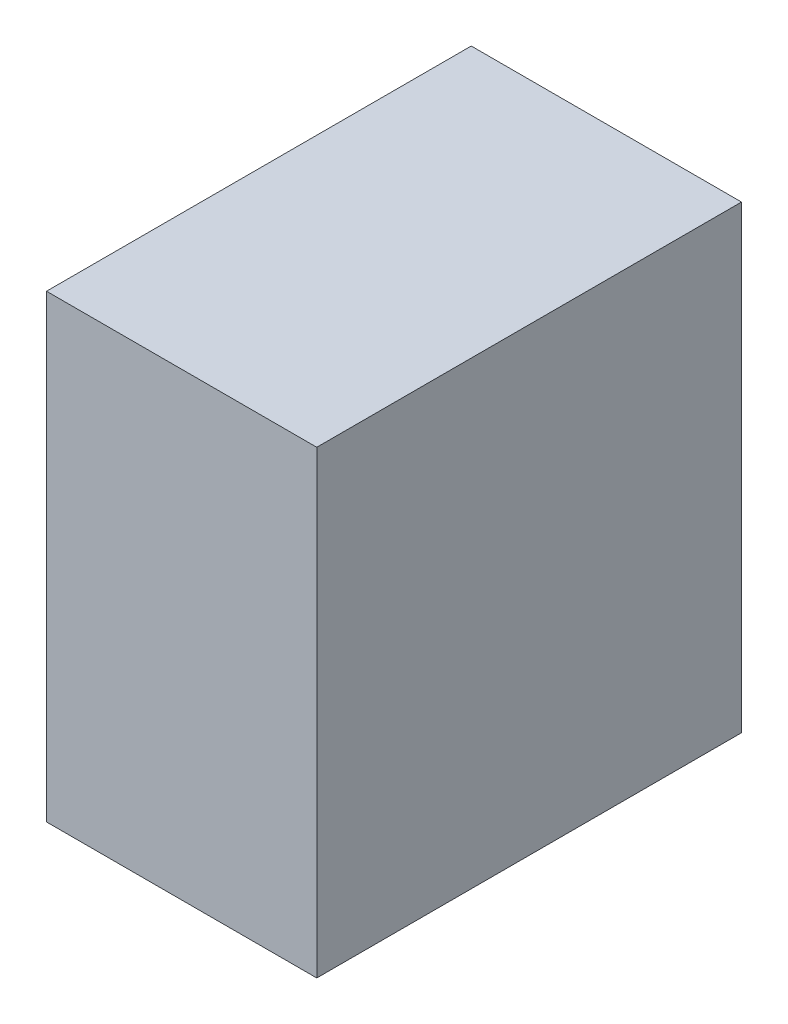
ISO-10303-21;
HEADER;
FILE_DESCRIPTION(('STEP AP214'),'2;1');
FILE_NAME('part.step','',(''),(''),'','','');
FILE_SCHEMA(('AUTOMOTIVE_DESIGN { 1 0 10303 214 1 1 1 1 }'));
ENDSEC;
DATA;
#1=APPLICATION_CONTEXT('core data for automotive mechanical design processes');
#2=APPLICATION_PROTOCOL_DEFINITION('international standard','automotive_design',2000,#1);
#3=PRODUCT_CONTEXT('',#1,'mechanical');
#4=PRODUCT('Part','Part','',(#3));
#5=PRODUCT_RELATED_PRODUCT_CATEGORY('part','',(#4));
#6=PRODUCT_DEFINITION_FORMATION('','',#4);
#7=PRODUCT_DEFINITION_CONTEXT('part definition',#1,'design');
#8=PRODUCT_DEFINITION('design','',#6,#7);
#9=PRODUCT_DEFINITION_SHAPE('','',#8);
#10=(LENGTH_UNIT() NAMED_UNIT(*) SI_UNIT(.MILLI.,.METRE.));
#11=(NAMED_UNIT(*) PLANE_ANGLE_UNIT() SI_UNIT($,.RADIAN.));
#12=(NAMED_UNIT(*) SI_UNIT($,.STERADIAN.) SOLID_ANGLE_UNIT());
#13=UNCERTAINTY_MEASURE_WITH_UNIT(LENGTH_MEASURE(1.E-05),#10,'distance_accuracy_value','');
#14=(GEOMETRIC_REPRESENTATION_CONTEXT(3) GLOBAL_UNCERTAINTY_ASSIGNED_CONTEXT((#13)) GLOBAL_UNIT_ASSIGNED_CONTEXT((#10,
#11,#12)) REPRESENTATION_CONTEXT('',''));
#15=CARTESIAN_POINT('',(0.,0.,0.));
#16=DIRECTION('',(0.,0.,1.));
#17=DIRECTION('',(1.,0.,0.));
#18=AXIS2_PLACEMENT_3D('',#15,#16,#17);
#19=CARTESIAN_POINT('',(40.3,20.3220000107563,7.27));
#20=DIRECTION('',(1.,0.,0.));
#21=DIRECTION('',(0.,1.,0.));
#22=AXIS2_PLACEMENT_3D('',#19,#20,#21);
#23=PLANE('',#22);
#24=DIRECTION('',(0.,0.,1.));
#25=VECTOR('',#24,1.);
#26=CARTESIAN_POINT('',(40.3,12.3220000107563,15.3525));
#27=LINE('',#26,#25);
#28=CARTESIAN_POINT('',(40.3,12.3220000107563,7.27));
#29=VERTEX_POINT('',#28);
#30=CARTESIAN_POINT('',(40.3,12.3220000107563,17.27));
#31=VERTEX_POINT('',#30);
#32=EDGE_CURVE('E74',#29,#31,#27,.T.);
#33=ORIENTED_EDGE('',*,*,#32,.T.);
#34=DIRECTION('',(0.,-1.,0.));
#35=VECTOR('',#34,1.);
#36=CARTESIAN_POINT('',(40.3,20.3220000107563,17.27));
#37=LINE('',#36,#35);
#38=CARTESIAN_POINT('',(40.3,1.49999995944139,17.27));
#39=VERTEX_POINT('',#38);
#40=EDGE_CURVE('E11',#31,#39,#37,.T.);
#41=ORIENTED_EDGE('',*,*,#40,.T.);
#42=DIRECTION('',(0.,0.,1.));
#43=VECTOR('',#42,1.);
#44=CARTESIAN_POINT('',(40.3,1.5,3.635));
#45=LINE('',#44,#43);
#46=CARTESIAN_POINT('',(40.3,1.49999995944139,7.27));
#47=VERTEX_POINT('',#46);
#48=EDGE_CURVE('E77',#47,#39,#45,.T.);
#49=ORIENTED_EDGE('',*,*,#48,.F.);
#50=DIRECTION('',(0.,-1.,0.));
#51=VECTOR('',#50,1.);
#52=CARTESIAN_POINT('',(40.3,20.3220000107563,7.27));
#53=LINE('',#52,#51);
#54=EDGE_CURVE('E28',#29,#47,#53,.T.);
#55=ORIENTED_EDGE('',*,*,#54,.F.);
#56=EDGE_LOOP('',(#33,#41,#49,#55));
#57=FACE_BOUND('',#56,.T.);
#58=ADVANCED_FACE('F17',(#57),#23,.T.);
#59=CARTESIAN_POINT('',(40.3,20.3220000107563,17.27));
#60=DIRECTION('',(0.,0.,1.));
#61=DIRECTION('',(0.,-1.,0.));
#62=AXIS2_PLACEMENT_3D('',#59,#60,#61);
#63=PLANE('',#62);
#64=DIRECTION('',(-1.,0.,0.));
#65=VECTOR('',#64,1.);
#66=CARTESIAN_POINT('',(39.2847851604859,12.3220000107563,17.27));
#67=LINE('',#66,#65);
#68=CARTESIAN_POINT('',(33.9369990081897,12.3220000107563,17.27));
#69=VERTEX_POINT('',#68);
#70=EDGE_CURVE('E86',#31,#69,#67,.T.);
#71=ORIENTED_EDGE('',*,*,#70,.T.);
#72=DIRECTION('',(0.,-1.,0.));
#73=VECTOR('',#72,1.);
#74=CARTESIAN_POINT('',(33.9369990081897,20.3220000107563,17.27));
#75=LINE('',#74,#73);
#76=CARTESIAN_POINT('',(33.9369990081897,1.49999995944139,17.27));
#77=VERTEX_POINT('',#76);
#78=EDGE_CURVE('E80',#69,#77,#75,.T.);
#79=ORIENTED_EDGE('',*,*,#78,.T.);
#80=DIRECTION('',(-1.,0.,0.));
#81=VECTOR('',#80,1.);
#82=CARTESIAN_POINT('',(20.15,1.5,17.27));
#83=LINE('',#82,#81);
#84=EDGE_CURVE('E92',#39,#77,#83,.T.);
#85=ORIENTED_EDGE('',*,*,#84,.F.);
#86=ORIENTED_EDGE('',*,*,#40,.F.);
#87=EDGE_LOOP('',(#71,#79,#85,#86));
#88=FACE_BOUND('',#87,.T.);
#89=ADVANCED_FACE('F119',(#88),#63,.T.);
#90=CARTESIAN_POINT('',(33.9369990081897,20.3220000107563,7.27));
#91=DIRECTION('',(0.,0.,-1.));
#92=DIRECTION('',(0.,-1.,0.));
#93=AXIS2_PLACEMENT_3D('',#90,#91,#92);
#94=PLANE('',#93);
#95=DIRECTION('',(1.,0.,0.));
#96=VECTOR('',#95,1.);
#97=CARTESIAN_POINT('',(36.1032846645808,12.3220000107563,7.27));
#98=LINE('',#97,#96);
#99=CARTESIAN_POINT('',(33.9369990081897,12.3220000107563,7.27));
#100=VERTEX_POINT('',#99);
#101=EDGE_CURVE('E21',#100,#29,#98,.T.);
#102=ORIENTED_EDGE('',*,*,#101,.T.);
#103=ORIENTED_EDGE('',*,*,#54,.T.);
#104=DIRECTION('',(1.,0.,0.));
#105=VECTOR('',#104,1.);
#106=CARTESIAN_POINT('',(16.9684995040948,1.5,7.27));
#107=LINE('',#106,#105);
#108=CARTESIAN_POINT('',(33.9369990081897,1.49999995944138,7.27));
#109=VERTEX_POINT('',#108);
#110=EDGE_CURVE('E106',#109,#47,#107,.T.);
#111=ORIENTED_EDGE('',*,*,#110,.F.);
#112=DIRECTION('',(0.,-1.,0.));
#113=VECTOR('',#112,1.);
#114=CARTESIAN_POINT('',(33.9369990081897,20.3220000107563,7.27));
#115=LINE('',#114,#113);
#116=EDGE_CURVE('E66',#100,#109,#115,.T.);
#117=ORIENTED_EDGE('',*,*,#116,.F.);
#118=EDGE_LOOP('',(#102,#103,#111,#117));
#119=FACE_BOUND('',#118,.T.);
#120=ADVANCED_FACE('F89',(#119),#94,.T.);
#121=CARTESIAN_POINT('',(33.9369990081897,20.3220000107563,17.27));
#122=DIRECTION('',(-1.,0.,0.));
#123=DIRECTION('',(0.,1.,0.));
#124=AXIS2_PLACEMENT_3D('',#121,#122,#123);
#125=PLANE('',#124);
#126=DIRECTION('',(0.,0.,-1.));
#127=VECTOR('',#126,1.);
#128=CARTESIAN_POINT('',(33.9369990081897,12.3220000107563,20.3525));
#129=LINE('',#128,#127);
#130=EDGE_CURVE('E91',#69,#100,#129,.T.);
#131=ORIENTED_EDGE('',*,*,#130,.T.);
#132=ORIENTED_EDGE('',*,*,#116,.T.);
#133=DIRECTION('',(0.,0.,-1.));
#134=VECTOR('',#133,1.);
#135=CARTESIAN_POINT('',(33.9369990081897,1.5,8.635));
#136=LINE('',#135,#134);
#137=EDGE_CURVE('E113',#77,#109,#136,.T.);
#138=ORIENTED_EDGE('',*,*,#137,.F.);
#139=ORIENTED_EDGE('',*,*,#78,.F.);
#140=EDGE_LOOP('',(#131,#132,#138,#139));
#141=FACE_BOUND('',#140,.T.);
#142=ADVANCED_FACE('F19',(#141),#125,.T.);
#143=CARTESIAN_POINT('',(38.2695703209719,12.3220000107563,23.435));
#144=DIRECTION('',(0.,-1.,0.));
#145=DIRECTION('',(0.,0.,-1.));
#146=AXIS2_PLACEMENT_3D('',#143,#144,#145);
#147=PLANE('',#146);
#148=ORIENTED_EDGE('',*,*,#101,.F.);
#149=ORIENTED_EDGE('',*,*,#130,.F.);
#150=ORIENTED_EDGE('',*,*,#70,.F.);
#151=ORIENTED_EDGE('',*,*,#32,.F.);
#152=EDGE_LOOP('',(#148,#149,#150,#151));
#153=FACE_BOUND('',#152,.T.);
#154=ADVANCED_FACE('F84',(#153),#147,.F.);
#155=CARTESIAN_POINT('',(-0.14892918312297,1.49999995944139,0.));
#156=DIRECTION('',(0.,-1.,0.));
#157=DIRECTION('',(0.,0.,-1.));
#158=AXIS2_PLACEMENT_3D('',#155,#156,#157);
#159=PLANE('',#158);
#160=ORIENTED_EDGE('',*,*,#137,.T.);
#161=ORIENTED_EDGE('',*,*,#110,.T.);
#162=ORIENTED_EDGE('',*,*,#48,.T.);
#163=ORIENTED_EDGE('',*,*,#84,.T.);
#164=EDGE_LOOP('',(#160,#161,#162,#163));
#165=FACE_BOUND('',#164,.T.);
#166=ADVANCED_FACE('F156',(#165),#159,.T.);
#167=CLOSED_SHELL('',(#58,#89,#120,#142,#154,#166));
#168=MANIFOLD_SOLID_BREP('B1',#167);
#169=ADVANCED_BREP_SHAPE_REPRESENTATION('',(#18,#168),#14);
#170=SHAPE_DEFINITION_REPRESENTATION(#9,#169);
ENDSEC;
END-ISO-10303-21;
